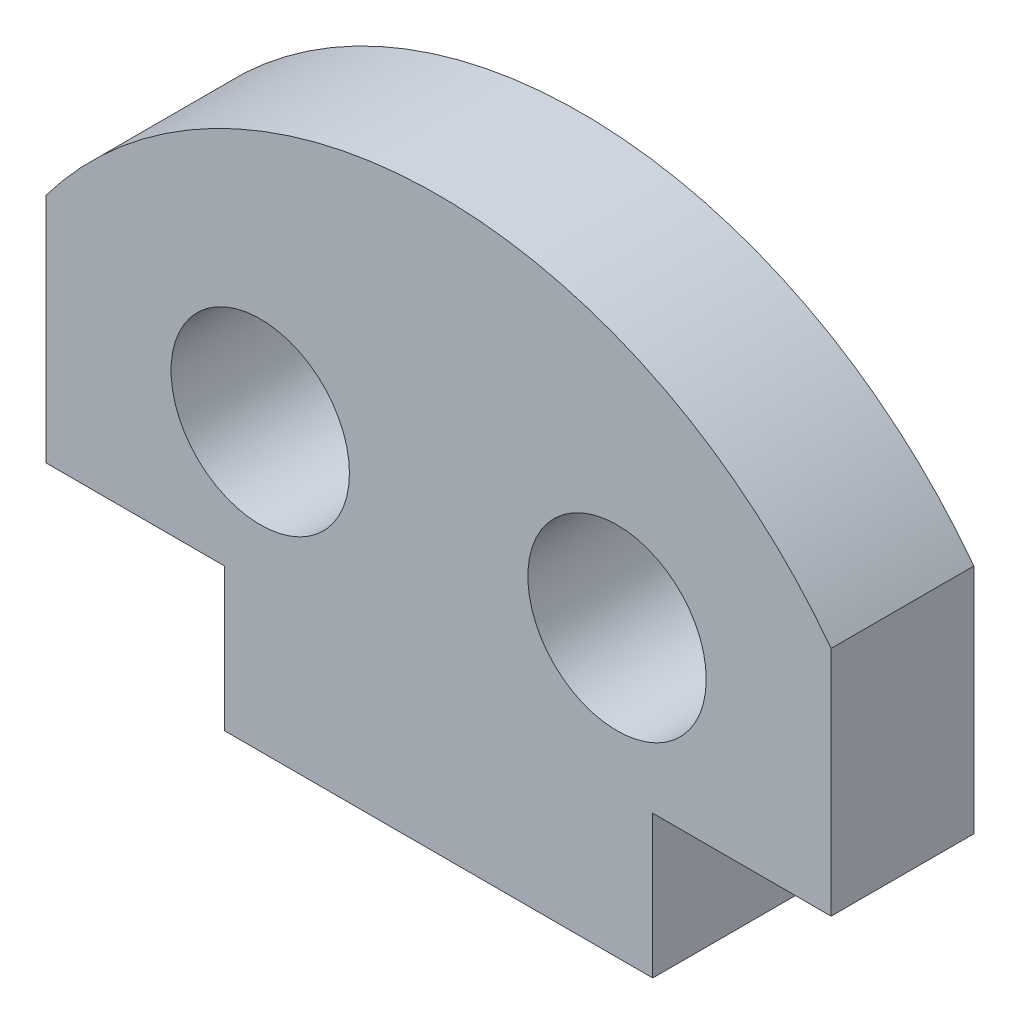
ISO-10303-21;
HEADER;
FILE_DESCRIPTION(('STEP AP214'),'2;1');
FILE_NAME('part.step','',(''),(''),'','','');
FILE_SCHEMA(('AUTOMOTIVE_DESIGN { 1 0 10303 214 1 1 1 1 }'));
ENDSEC;
DATA;
#1=APPLICATION_CONTEXT('core data for automotive mechanical design processes');
#2=APPLICATION_PROTOCOL_DEFINITION('international standard','automotive_design',2000,#1);
#3=PRODUCT_CONTEXT('',#1,'mechanical');
#4=PRODUCT('Part','Part','',(#3));
#5=PRODUCT_RELATED_PRODUCT_CATEGORY('part','',(#4));
#6=PRODUCT_DEFINITION_FORMATION('','',#4);
#7=PRODUCT_DEFINITION_CONTEXT('part definition',#1,'design');
#8=PRODUCT_DEFINITION('design','',#6,#7);
#9=PRODUCT_DEFINITION_SHAPE('','',#8);
#10=(LENGTH_UNIT() NAMED_UNIT(*) SI_UNIT(.MILLI.,.METRE.));
#11=(NAMED_UNIT(*) PLANE_ANGLE_UNIT() SI_UNIT($,.RADIAN.));
#12=(NAMED_UNIT(*) SI_UNIT($,.STERADIAN.) SOLID_ANGLE_UNIT());
#13=UNCERTAINTY_MEASURE_WITH_UNIT(LENGTH_MEASURE(1.E-05),#10,'distance_accuracy_value','');
#14=(GEOMETRIC_REPRESENTATION_CONTEXT(3) GLOBAL_UNCERTAINTY_ASSIGNED_CONTEXT((#13)) GLOBAL_UNIT_ASSIGNED_CONTEXT((#10,
#11,#12)) REPRESENTATION_CONTEXT('',''));
#15=CARTESIAN_POINT('',(0.,0.,0.));
#16=DIRECTION('',(0.,0.,1.));
#17=DIRECTION('',(1.,0.,0.));
#18=AXIS2_PLACEMENT_3D('',#15,#16,#17);
#19=CARTESIAN_POINT('',(1956.67680872112,1458.00911595094,2.));
#20=DIRECTION('',(0.,0.,1.));
#21=DIRECTION('',(1.,0.,0.));
#22=AXIS2_PLACEMENT_3D('',#19,#20,#21);
#23=PLANE('',#22);
#24=CARTESIAN_POINT('',(1959.17680872112,1460.88411595094,2.));
#25=DIRECTION('',(0.,0.,1.));
#26=DIRECTION('',(1.,0.,0.));
#27=AXIS2_PLACEMENT_3D('',#24,#25,#26);
#28=CIRCLE('',#27,1.24999999999997);
#29=CARTESIAN_POINT('',(1960.42680872112,1460.88411595094,2.));
#30=VERTEX_POINT('',#29);
#31=EDGE_CURVE('E134',#30,#30,#28,.T.);
#32=ORIENTED_EDGE('',*,*,#31,.F.);
#33=EDGE_LOOP('',(#32));
#34=FACE_BOUND('',#33,.T.);
#35=CARTESIAN_POINT('',(1956.67680872112,1458.00911595094,2.));
#36=DIRECTION('',(0.,0.,1.));
#37=DIRECTION('',(1.,0.,0.));
#38=AXIS2_PLACEMENT_3D('',#35,#36,#37);
#39=CIRCLE('',#38,6.87500000000529);
#40=CARTESIAN_POINT('',(1962.17680872112,1462.13411595095,2.));
#41=VERTEX_POINT('',#40);
#42=CARTESIAN_POINT('',(1951.17680872112,1462.13411595095,2.));
#43=VERTEX_POINT('',#42);
#44=EDGE_CURVE('E145',#41,#43,#39,.T.);
#45=ORIENTED_EDGE('',*,*,#44,.T.);
#46=DIRECTION('',(0.,-1.,0.));
#47=VECTOR('',#46,1.);
#48=CARTESIAN_POINT('',(1951.17680872112,1458.88411595094,2.));
#49=LINE('',#48,#47);
#50=CARTESIAN_POINT('',(1951.17680872112,1458.88411595094,2.));
#51=VERTEX_POINT('',#50);
#52=EDGE_CURVE('E93',#43,#51,#49,.T.);
#53=ORIENTED_EDGE('',*,*,#52,.T.);
#54=DIRECTION('',(1.,0.,0.));
#55=VECTOR('',#54,1.);
#56=CARTESIAN_POINT('',(1953.67680872112,1458.88411595094,2.));
#57=LINE('',#56,#55);
#58=CARTESIAN_POINT('',(1953.67680872112,1458.88411595094,2.));
#59=VERTEX_POINT('',#58);
#60=EDGE_CURVE('E160',#51,#59,#57,.T.);
#61=ORIENTED_EDGE('',*,*,#60,.T.);
#62=DIRECTION('',(0.,-1.,0.));
#63=VECTOR('',#62,1.);
#64=CARTESIAN_POINT('',(1953.67680872112,1458.88411595094,2.));
#65=LINE('',#64,#63);
#66=CARTESIAN_POINT('',(1953.67680872112,1456.88411595094,2.));
#67=VERTEX_POINT('',#66);
#68=EDGE_CURVE('E173',#59,#67,#65,.T.);
#69=ORIENTED_EDGE('',*,*,#68,.T.);
#70=DIRECTION('',(1.,0.,0.));
#71=VECTOR('',#70,1.);
#72=CARTESIAN_POINT('',(1953.67680872112,1456.88411595094,2.));
#73=LINE('',#72,#71);
#74=CARTESIAN_POINT('',(1959.67680872112,1456.88411595094,2.));
#75=VERTEX_POINT('',#74);
#76=EDGE_CURVE('E112',#67,#75,#73,.T.);
#77=ORIENTED_EDGE('',*,*,#76,.T.);
#78=DIRECTION('',(0.,1.,0.));
#79=VECTOR('',#78,1.);
#80=CARTESIAN_POINT('',(1959.67680872112,1456.88411595094,2.));
#81=LINE('',#80,#79);
#82=CARTESIAN_POINT('',(1959.67680872112,1458.88411595095,2.));
#83=VERTEX_POINT('',#82);
#84=EDGE_CURVE('E106',#75,#83,#81,.T.);
#85=ORIENTED_EDGE('',*,*,#84,.T.);
#86=DIRECTION('',(1.,0.,0.));
#87=VECTOR('',#86,1.);
#88=CARTESIAN_POINT('',(1962.17680872112,1458.88411595095,2.));
#89=LINE('',#88,#87);
#90=CARTESIAN_POINT('',(1962.17680872112,1458.88411595095,2.));
#91=VERTEX_POINT('',#90);
#92=EDGE_CURVE('E110',#83,#91,#89,.T.);
#93=ORIENTED_EDGE('',*,*,#92,.T.);
#94=DIRECTION('',(0.,1.,0.));
#95=VECTOR('',#94,1.);
#96=CARTESIAN_POINT('',(1962.17680872112,1458.88411595095,2.));
#97=LINE('',#96,#95);
#98=EDGE_CURVE('E50',#91,#41,#97,.T.);
#99=ORIENTED_EDGE('',*,*,#98,.T.);
#100=EDGE_LOOP('',(#45,#53,#61,#69,#77,#85,#93,#99));
#101=FACE_BOUND('',#100,.T.);
#102=CARTESIAN_POINT('',(1954.17680872112,1460.88411595095,2.));
#103=DIRECTION('',(0.,0.,1.));
#104=DIRECTION('',(1.,0.,0.));
#105=AXIS2_PLACEMENT_3D('',#102,#103,#104);
#106=CIRCLE('',#105,1.24999999999997);
#107=CARTESIAN_POINT('',(1955.42680872112,1460.88411595095,2.));
#108=VERTEX_POINT('',#107);
#109=EDGE_CURVE('E182',#108,#108,#106,.T.);
#110=ORIENTED_EDGE('',*,*,#109,.F.);
#111=EDGE_LOOP('',(#110));
#112=FACE_BOUND('',#111,.T.);
#113=ADVANCED_FACE('F33',(#34,#101,#112),#23,.T.);
#114=CARTESIAN_POINT('',(1956.67680872112,1458.00911595094,0.));
#115=DIRECTION('',(0.,0.,1.));
#116=DIRECTION('',(1.,0.,0.));
#117=AXIS2_PLACEMENT_3D('',#114,#115,#116);
#118=PLANE('',#117);
#119=CARTESIAN_POINT('',(1959.17680872112,1460.88411595094,0.));
#120=DIRECTION('',(0.,0.,1.));
#121=DIRECTION('',(1.,0.,0.));
#122=AXIS2_PLACEMENT_3D('',#119,#120,#121);
#123=CIRCLE('',#122,1.24999999999997);
#124=CARTESIAN_POINT('',(1960.42680872112,1460.88411595094,0.));
#125=VERTEX_POINT('',#124);
#126=EDGE_CURVE('E179',#125,#125,#123,.T.);
#127=ORIENTED_EDGE('',*,*,#126,.T.);
#128=EDGE_LOOP('',(#127));
#129=FACE_BOUND('',#128,.T.);
#130=CARTESIAN_POINT('',(1956.67680872112,1458.00911595094,0.));
#131=DIRECTION('',(0.,0.,1.));
#132=DIRECTION('',(1.,0.,0.));
#133=AXIS2_PLACEMENT_3D('',#130,#131,#132);
#134=CIRCLE('',#133,6.87500000000529);
#135=CARTESIAN_POINT('',(1962.17680872112,1462.13411595095,0.));
#136=VERTEX_POINT('',#135);
#137=CARTESIAN_POINT('',(1951.17680872112,1462.13411595095,0.));
#138=VERTEX_POINT('',#137);
#139=EDGE_CURVE('E130',#136,#138,#134,.T.);
#140=ORIENTED_EDGE('',*,*,#139,.F.);
#141=DIRECTION('',(0.,1.,0.));
#142=VECTOR('',#141,1.);
#143=CARTESIAN_POINT('',(1962.17680872112,1458.88411595095,0.));
#144=LINE('',#143,#142);
#145=CARTESIAN_POINT('',(1962.17680872112,1458.88411595095,0.));
#146=VERTEX_POINT('',#145);
#147=EDGE_CURVE('E85',#146,#136,#144,.T.);
#148=ORIENTED_EDGE('',*,*,#147,.F.);
#149=DIRECTION('',(1.,0.,0.));
#150=VECTOR('',#149,1.);
#151=CARTESIAN_POINT('',(1962.17680872112,1458.88411595095,0.));
#152=LINE('',#151,#150);
#153=CARTESIAN_POINT('',(1959.67680872112,1458.88411595095,0.));
#154=VERTEX_POINT('',#153);
#155=EDGE_CURVE('E79',#154,#146,#152,.T.);
#156=ORIENTED_EDGE('',*,*,#155,.F.);
#157=DIRECTION('',(0.,1.,0.));
#158=VECTOR('',#157,1.);
#159=CARTESIAN_POINT('',(1959.67680872112,1456.88411595094,0.));
#160=LINE('',#159,#158);
#161=CARTESIAN_POINT('',(1959.67680872112,1456.88411595094,0.));
#162=VERTEX_POINT('',#161);
#163=EDGE_CURVE('E120',#162,#154,#160,.T.);
#164=ORIENTED_EDGE('',*,*,#163,.F.);
#165=DIRECTION('',(1.,0.,0.));
#166=VECTOR('',#165,1.);
#167=CARTESIAN_POINT('',(1953.67680872112,1456.88411595094,0.));
#168=LINE('',#167,#166);
#169=CARTESIAN_POINT('',(1953.67680872112,1456.88411595094,0.));
#170=VERTEX_POINT('',#169);
#171=EDGE_CURVE('E140',#170,#162,#168,.T.);
#172=ORIENTED_EDGE('',*,*,#171,.F.);
#173=DIRECTION('',(0.,-1.,0.));
#174=VECTOR('',#173,1.);
#175=CARTESIAN_POINT('',(1953.67680872112,1458.88411595094,0.));
#176=LINE('',#175,#174);
#177=CARTESIAN_POINT('',(1953.67680872112,1458.88411595094,0.));
#178=VERTEX_POINT('',#177);
#179=EDGE_CURVE('E138',#178,#170,#176,.T.);
#180=ORIENTED_EDGE('',*,*,#179,.F.);
#181=DIRECTION('',(1.,0.,0.));
#182=VECTOR('',#181,1.);
#183=CARTESIAN_POINT('',(1953.67680872112,1458.88411595094,0.));
#184=LINE('',#183,#182);
#185=CARTESIAN_POINT('',(1951.17680872112,1458.88411595094,0.));
#186=VERTEX_POINT('',#185);
#187=EDGE_CURVE('E136',#186,#178,#184,.T.);
#188=ORIENTED_EDGE('',*,*,#187,.F.);
#189=DIRECTION('',(0.,-1.,0.));
#190=VECTOR('',#189,1.);
#191=CARTESIAN_POINT('',(1951.17680872112,1458.88411595094,0.));
#192=LINE('',#191,#190);
#193=EDGE_CURVE('E133',#138,#186,#192,.T.);
#194=ORIENTED_EDGE('',*,*,#193,.F.);
#195=EDGE_LOOP('',(#140,#148,#156,#164,#172,#180,#188,#194));
#196=FACE_BOUND('',#195,.T.);
#197=CARTESIAN_POINT('',(1954.17680872112,1460.88411595095,0.));
#198=DIRECTION('',(0.,0.,1.));
#199=DIRECTION('',(1.,0.,0.));
#200=AXIS2_PLACEMENT_3D('',#197,#198,#199);
#201=CIRCLE('',#200,1.24999999999997);
#202=CARTESIAN_POINT('',(1955.42680872112,1460.88411595095,0.));
#203=VERTEX_POINT('',#202);
#204=EDGE_CURVE('E185',#203,#203,#201,.T.);
#205=ORIENTED_EDGE('',*,*,#204,.T.);
#206=EDGE_LOOP('',(#205));
#207=FACE_BOUND('',#206,.T.);
#208=ADVANCED_FACE('F164',(#129,#196,#207),#118,.F.);
#209=CARTESIAN_POINT('',(1956.67680872112,1458.00911595094,2.));
#210=DIRECTION('',(0.,0.,-1.));
#211=DIRECTION('',(-1.,0.,0.));
#212=AXIS2_PLACEMENT_3D('',#209,#210,#211);
#213=CYLINDRICAL_SURFACE('',#212,6.87500000000529);
#214=ORIENTED_EDGE('',*,*,#139,.T.);
#215=DIRECTION('',(0.,0.,-1.));
#216=VECTOR('',#215,1.);
#217=CARTESIAN_POINT('',(1951.17680872112,1462.13411595095,2.));
#218=LINE('',#217,#216);
#219=EDGE_CURVE('E11',#43,#138,#218,.T.);
#220=ORIENTED_EDGE('',*,*,#219,.F.);
#221=ORIENTED_EDGE('',*,*,#44,.F.);
#222=DIRECTION('',(0.,0.,-1.));
#223=VECTOR('',#222,1.);
#224=CARTESIAN_POINT('',(1962.17680872112,1462.13411595095,2.));
#225=LINE('',#224,#223);
#226=EDGE_CURVE('E126',#41,#136,#225,.T.);
#227=ORIENTED_EDGE('',*,*,#226,.T.);
#228=EDGE_LOOP('',(#214,#220,#221,#227));
#229=FACE_BOUND('',#228,.T.);
#230=ADVANCED_FACE('F35',(#229),#213,.T.);
#231=CARTESIAN_POINT('',(1951.17680872112,1458.88411595094,2.));
#232=DIRECTION('',(1.,0.,0.));
#233=DIRECTION('',(0.,0.,-1.));
#234=AXIS2_PLACEMENT_3D('',#231,#232,#233);
#235=PLANE('',#234);
#236=ORIENTED_EDGE('',*,*,#193,.T.);
#237=DIRECTION('',(0.,0.,-1.));
#238=VECTOR('',#237,1.);
#239=CARTESIAN_POINT('',(1951.17680872112,1458.88411595094,2.));
#240=LINE('',#239,#238);
#241=EDGE_CURVE('E42',#51,#186,#240,.T.);
#242=ORIENTED_EDGE('',*,*,#241,.F.);
#243=ORIENTED_EDGE('',*,*,#52,.F.);
#244=ORIENTED_EDGE('',*,*,#219,.T.);
#245=EDGE_LOOP('',(#236,#242,#243,#244));
#246=FACE_BOUND('',#245,.T.);
#247=ADVANCED_FACE('F218',(#246),#235,.F.);
#248=CARTESIAN_POINT('',(1953.67680872112,1458.88411595094,2.));
#249=DIRECTION('',(0.,1.,0.));
#250=DIRECTION('',(0.,0.,1.));
#251=AXIS2_PLACEMENT_3D('',#248,#249,#250);
#252=PLANE('',#251);
#253=ORIENTED_EDGE('',*,*,#187,.T.);
#254=DIRECTION('',(0.,0.,-1.));
#255=VECTOR('',#254,1.);
#256=CARTESIAN_POINT('',(1953.67680872112,1458.88411595094,2.));
#257=LINE('',#256,#255);
#258=EDGE_CURVE('E152',#59,#178,#257,.T.);
#259=ORIENTED_EDGE('',*,*,#258,.F.);
#260=ORIENTED_EDGE('',*,*,#60,.F.);
#261=ORIENTED_EDGE('',*,*,#241,.T.);
#262=EDGE_LOOP('',(#253,#259,#260,#261));
#263=FACE_BOUND('',#262,.T.);
#264=ADVANCED_FACE('F158',(#263),#252,.F.);
#265=CARTESIAN_POINT('',(1953.67680872112,1458.88411595094,2.));
#266=DIRECTION('',(1.,0.,0.));
#267=DIRECTION('',(0.,0.,-1.));
#268=AXIS2_PLACEMENT_3D('',#265,#266,#267);
#269=PLANE('',#268);
#270=ORIENTED_EDGE('',*,*,#179,.T.);
#271=DIRECTION('',(0.,0.,-1.));
#272=VECTOR('',#271,1.);
#273=CARTESIAN_POINT('',(1953.67680872112,1456.88411595094,2.));
#274=LINE('',#273,#272);
#275=EDGE_CURVE('E149',#67,#170,#274,.T.);
#276=ORIENTED_EDGE('',*,*,#275,.F.);
#277=ORIENTED_EDGE('',*,*,#68,.F.);
#278=ORIENTED_EDGE('',*,*,#258,.T.);
#279=EDGE_LOOP('',(#270,#276,#277,#278));
#280=FACE_BOUND('',#279,.T.);
#281=ADVANCED_FACE('F169',(#280),#269,.F.);
#282=CARTESIAN_POINT('',(1953.67680872112,1456.88411595094,2.));
#283=DIRECTION('',(0.,1.,0.));
#284=DIRECTION('',(0.,0.,1.));
#285=AXIS2_PLACEMENT_3D('',#282,#283,#284);
#286=PLANE('',#285);
#287=ORIENTED_EDGE('',*,*,#171,.T.);
#288=DIRECTION('',(0.,0.,-1.));
#289=VECTOR('',#288,1.);
#290=CARTESIAN_POINT('',(1959.67680872112,1456.88411595094,2.));
#291=LINE('',#290,#289);
#292=EDGE_CURVE('E121',#75,#162,#291,.T.);
#293=ORIENTED_EDGE('',*,*,#292,.F.);
#294=ORIENTED_EDGE('',*,*,#76,.F.);
#295=ORIENTED_EDGE('',*,*,#275,.T.);
#296=EDGE_LOOP('',(#287,#293,#294,#295));
#297=FACE_BOUND('',#296,.T.);
#298=ADVANCED_FACE('F172',(#297),#286,.F.);
#299=CARTESIAN_POINT('',(1959.67680872112,1456.88411595094,2.));
#300=DIRECTION('',(-1.,0.,0.));
#301=DIRECTION('',(0.,0.,1.));
#302=AXIS2_PLACEMENT_3D('',#299,#300,#301);
#303=PLANE('',#302);
#304=ORIENTED_EDGE('',*,*,#163,.T.);
#305=DIRECTION('',(0.,0.,-1.));
#306=VECTOR('',#305,1.);
#307=CARTESIAN_POINT('',(1959.67680872112,1458.88411595095,2.));
#308=LINE('',#307,#306);
#309=EDGE_CURVE('E117',#83,#154,#308,.T.);
#310=ORIENTED_EDGE('',*,*,#309,.F.);
#311=ORIENTED_EDGE('',*,*,#84,.F.);
#312=ORIENTED_EDGE('',*,*,#292,.T.);
#313=EDGE_LOOP('',(#304,#310,#311,#312));
#314=FACE_BOUND('',#313,.T.);
#315=ADVANCED_FACE('F118',(#314),#303,.F.);
#316=CARTESIAN_POINT('',(1962.17680872112,1458.88411595095,2.));
#317=DIRECTION('',(0.,1.,0.));
#318=DIRECTION('',(0.,0.,1.));
#319=AXIS2_PLACEMENT_3D('',#316,#317,#318);
#320=PLANE('',#319);
#321=ORIENTED_EDGE('',*,*,#155,.T.);
#322=DIRECTION('',(0.,0.,-1.));
#323=VECTOR('',#322,1.);
#324=CARTESIAN_POINT('',(1962.17680872112,1458.88411595095,2.));
#325=LINE('',#324,#323);
#326=EDGE_CURVE('E122',#91,#146,#325,.T.);
#327=ORIENTED_EDGE('',*,*,#326,.F.);
#328=ORIENTED_EDGE('',*,*,#92,.F.);
#329=ORIENTED_EDGE('',*,*,#309,.T.);
#330=EDGE_LOOP('',(#321,#327,#328,#329));
#331=FACE_BOUND('',#330,.T.);
#332=ADVANCED_FACE('F124',(#331),#320,.F.);
#333=CARTESIAN_POINT('',(1962.17680872112,1458.88411595095,2.));
#334=DIRECTION('',(-1.,0.,0.));
#335=DIRECTION('',(0.,0.,1.));
#336=AXIS2_PLACEMENT_3D('',#333,#334,#335);
#337=PLANE('',#336);
#338=ORIENTED_EDGE('',*,*,#147,.T.);
#339=ORIENTED_EDGE('',*,*,#226,.F.);
#340=ORIENTED_EDGE('',*,*,#98,.F.);
#341=ORIENTED_EDGE('',*,*,#326,.T.);
#342=EDGE_LOOP('',(#338,#339,#340,#341));
#343=FACE_BOUND('',#342,.T.);
#344=ADVANCED_FACE('F206',(#343),#337,.F.);
#345=CARTESIAN_POINT('',(1959.17680872112,1460.88411595094,2.));
#346=DIRECTION('',(0.,0.,-1.));
#347=DIRECTION('',(-1.,0.,0.));
#348=AXIS2_PLACEMENT_3D('',#345,#346,#347);
#349=CYLINDRICAL_SURFACE('',#348,1.24999999999997);
#350=ORIENTED_EDGE('',*,*,#31,.T.);
#351=EDGE_LOOP('',(#350));
#352=FACE_BOUND('',#351,.T.);
#353=ORIENTED_EDGE('',*,*,#126,.F.);
#354=EDGE_LOOP('',(#353));
#355=FACE_BOUND('',#354,.T.);
#356=ADVANCED_FACE('F203',(#352,#355),#349,.F.);
#357=CARTESIAN_POINT('',(1954.17680872112,1460.88411595095,2.));
#358=DIRECTION('',(0.,0.,-1.));
#359=DIRECTION('',(-1.,0.,0.));
#360=AXIS2_PLACEMENT_3D('',#357,#358,#359);
#361=CYLINDRICAL_SURFACE('',#360,1.24999999999997);
#362=ORIENTED_EDGE('',*,*,#109,.T.);
#363=EDGE_LOOP('',(#362));
#364=FACE_BOUND('',#363,.T.);
#365=ORIENTED_EDGE('',*,*,#204,.F.);
#366=EDGE_LOOP('',(#365));
#367=FACE_BOUND('',#366,.T.);
#368=ADVANCED_FACE('F191',(#364,#367),#361,.F.);
#369=CLOSED_SHELL('',(#113,#208,#230,#247,#264,#281,#298,#315,#332,#344,#356,#368));
#370=MANIFOLD_SOLID_BREP('B2',#369);
#371=ADVANCED_BREP_SHAPE_REPRESENTATION('',(#18,#370),#14);
#372=SHAPE_DEFINITION_REPRESENTATION(#9,#371);
ENDSEC;
END-ISO-10303-21;
